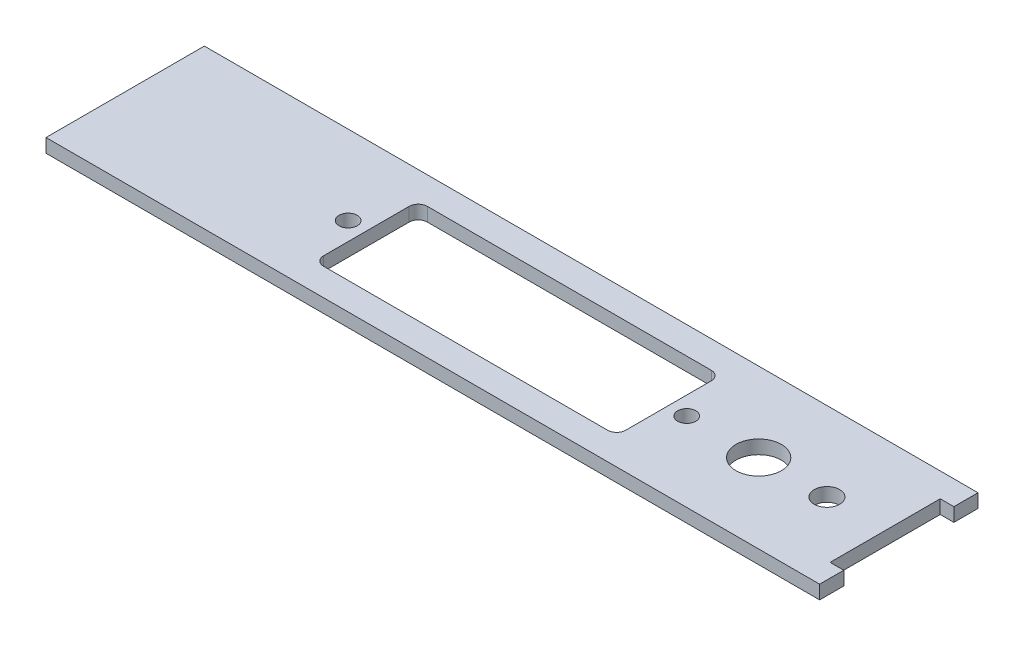
ISO-10303-21;
HEADER;
FILE_DESCRIPTION(('STEP AP214'),'2;1');
FILE_NAME('part.step','',(''),(''),'','','');
FILE_SCHEMA(('AUTOMOTIVE_DESIGN { 1 0 10303 214 1 1 1 1 }'));
ENDSEC;
DATA;
#1=APPLICATION_CONTEXT('core data for automotive mechanical design processes');
#2=APPLICATION_PROTOCOL_DEFINITION('international standard','automotive_design',2000,#1);
#3=PRODUCT_CONTEXT('',#1,'mechanical');
#4=PRODUCT('Part','Part','',(#3));
#5=PRODUCT_RELATED_PRODUCT_CATEGORY('part','',(#4));
#6=PRODUCT_DEFINITION_FORMATION('','',#4);
#7=PRODUCT_DEFINITION_CONTEXT('part definition',#1,'design');
#8=PRODUCT_DEFINITION('design','',#6,#7);
#9=PRODUCT_DEFINITION_SHAPE('','',#8);
#10=(LENGTH_UNIT() NAMED_UNIT(*) SI_UNIT(.MILLI.,.METRE.));
#11=(NAMED_UNIT(*) PLANE_ANGLE_UNIT() SI_UNIT($,.RADIAN.));
#12=(NAMED_UNIT(*) SI_UNIT($,.STERADIAN.) SOLID_ANGLE_UNIT());
#13=UNCERTAINTY_MEASURE_WITH_UNIT(LENGTH_MEASURE(1.E-05),#10,'distance_accuracy_value','');
#14=(GEOMETRIC_REPRESENTATION_CONTEXT(3) GLOBAL_UNCERTAINTY_ASSIGNED_CONTEXT((#13)) GLOBAL_UNIT_ASSIGNED_CONTEXT((#10,
#11,#12)) REPRESENTATION_CONTEXT('',''));
#15=CARTESIAN_POINT('',(0.,0.,0.));
#16=DIRECTION('',(0.,0.,1.));
#17=DIRECTION('',(1.,0.,0.));
#18=AXIS2_PLACEMENT_3D('',#15,#16,#17);
#19=CARTESIAN_POINT('',(0.,15.,0.));
#20=DIRECTION('',(0.,1.,0.));
#21=DIRECTION('',(0.,0.,1.));
#22=AXIS2_PLACEMENT_3D('',#19,#20,#21);
#23=PLANE('',#22);
#24=CARTESIAN_POINT('',(340.,15.,0.));
#25=DIRECTION('',(0.,1.,0.));
#26=DIRECTION('',(0.,0.,1.));
#27=AXIS2_PLACEMENT_3D('',#24,#25,#26);
#28=CIRCLE('',#27,14.);
#29=CARTESIAN_POINT('',(340.,15.,14.));
#30=VERTEX_POINT('',#29);
#31=EDGE_CURVE('E187',#30,#30,#28,.F.);
#32=ORIENTED_EDGE('',*,*,#31,.T.);
#33=EDGE_LOOP('',(#32));
#34=FACE_BOUND('',#33,.T.);
#35=CARTESIAN_POINT('',(186.,15.,0.));
#36=DIRECTION('',(0.,-1.,0.));
#37=DIRECTION('',(0.,0.,-1.));
#38=AXIS2_PLACEMENT_3D('',#35,#36,#37);
#39=CIRCLE('',#38,10.);
#40=CARTESIAN_POINT('',(186.,15.,-10.));
#41=VERTEX_POINT('',#40);
#42=EDGE_CURVE('E190',#41,#41,#39,.T.);
#43=ORIENTED_EDGE('',*,*,#42,.T.);
#44=EDGE_LOOP('',(#43));
#45=FACE_BOUND('',#44,.T.);
#46=CARTESIAN_POINT('',(-186.,15.,0.));
#47=DIRECTION('',(0.,-1.,0.));
#48=DIRECTION('',(0.,0.,-1.));
#49=AXIS2_PLACEMENT_3D('',#46,#47,#48);
#50=CIRCLE('',#49,10.);
#51=CARTESIAN_POINT('',(-186.,15.,-10.));
#52=VERTEX_POINT('',#51);
#53=EDGE_CURVE('E193',#52,#52,#50,.T.);
#54=ORIENTED_EDGE('',*,*,#53,.T.);
#55=EDGE_LOOP('',(#54));
#56=FACE_BOUND('',#55,.T.);
#57=CARTESIAN_POINT('',(156.,15.,47.));
#58=DIRECTION('',(0.,1.,0.));
#59=DIRECTION('',(0.,0.,1.));
#60=AXIS2_PLACEMENT_3D('',#57,#58,#59);
#61=CIRCLE('',#60,10.);
#62=CARTESIAN_POINT('',(166.,15.,47.));
#63=VERTEX_POINT('',#62);
#64=CARTESIAN_POINT('',(156.,15.,57.));
#65=VERTEX_POINT('',#64);
#66=EDGE_CURVE('E161',#63,#65,#61,.F.);
#67=ORIENTED_EDGE('',*,*,#66,.T.);
#68=DIRECTION('',(-1.,0.,0.));
#69=VECTOR('',#68,1.);
#70=CARTESIAN_POINT('',(166.,15.,57.));
#71=LINE('',#70,#69);
#72=CARTESIAN_POINT('',(-156.,15.,57.));
#73=VERTEX_POINT('',#72);
#74=EDGE_CURVE('E159',#73,#65,#71,.F.);
#75=ORIENTED_EDGE('',*,*,#74,.F.);
#76=CARTESIAN_POINT('',(-156.,15.,47.));
#77=DIRECTION('',(0.,1.,0.));
#78=DIRECTION('',(0.,0.,1.));
#79=AXIS2_PLACEMENT_3D('',#76,#77,#78);
#80=CIRCLE('',#79,10.);
#81=CARTESIAN_POINT('',(-166.,15.,47.));
#82=VERTEX_POINT('',#81);
#83=EDGE_CURVE('E158',#73,#82,#80,.F.);
#84=ORIENTED_EDGE('',*,*,#83,.T.);
#85=DIRECTION('',(0.,0.,-1.));
#86=VECTOR('',#85,1.);
#87=CARTESIAN_POINT('',(-166.,15.,57.));
#88=LINE('',#87,#86);
#89=CARTESIAN_POINT('',(-166.,15.,-47.));
#90=VERTEX_POINT('',#89);
#91=EDGE_CURVE('E155',#90,#82,#88,.F.);
#92=ORIENTED_EDGE('',*,*,#91,.F.);
#93=CARTESIAN_POINT('',(-156.,15.,-47.));
#94=DIRECTION('',(0.,1.,0.));
#95=DIRECTION('',(0.,0.,1.));
#96=AXIS2_PLACEMENT_3D('',#93,#94,#95);
#97=CIRCLE('',#96,10.);
#98=CARTESIAN_POINT('',(-156.,15.,-57.));
#99=VERTEX_POINT('',#98);
#100=EDGE_CURVE('E152',#90,#99,#97,.F.);
#101=ORIENTED_EDGE('',*,*,#100,.T.);
#102=DIRECTION('',(1.,0.,0.));
#103=VECTOR('',#102,1.);
#104=CARTESIAN_POINT('',(-166.,15.,-57.));
#105=LINE('',#104,#103);
#106=CARTESIAN_POINT('',(156.,15.,-57.));
#107=VERTEX_POINT('',#106);
#108=EDGE_CURVE('E149',#107,#99,#105,.F.);
#109=ORIENTED_EDGE('',*,*,#108,.F.);
#110=CARTESIAN_POINT('',(156.,15.,-47.));
#111=DIRECTION('',(0.,1.,0.));
#112=DIRECTION('',(0.,0.,1.));
#113=AXIS2_PLACEMENT_3D('',#110,#111,#112);
#114=CIRCLE('',#113,10.);
#115=CARTESIAN_POINT('',(166.,15.,-47.));
#116=VERTEX_POINT('',#115);
#117=EDGE_CURVE('E196',#107,#116,#114,.F.);
#118=ORIENTED_EDGE('',*,*,#117,.T.);
#119=DIRECTION('',(0.,0.,1.));
#120=VECTOR('',#119,1.);
#121=CARTESIAN_POINT('',(166.,15.,-57.));
#122=LINE('',#121,#120);
#123=EDGE_CURVE('E86',#63,#116,#122,.F.);
#124=ORIENTED_EDGE('',*,*,#123,.F.);
#125=EDGE_LOOP('',(#67,#75,#84,#92,#101,#109,#118,#124));
#126=FACE_BOUND('',#125,.T.);
#127=CARTESIAN_POINT('',(265.,15.,0.));
#128=DIRECTION('',(0.,1.,0.));
#129=DIRECTION('',(0.,0.,1.));
#130=AXIS2_PLACEMENT_3D('',#127,#128,#129);
#131=CIRCLE('',#130,25.);
#132=CARTESIAN_POINT('',(265.,15.,25.));
#133=VERTEX_POINT('',#132);
#134=EDGE_CURVE('E20',#133,#133,#131,.F.);
#135=ORIENTED_EDGE('',*,*,#134,.T.);
#136=EDGE_LOOP('',(#135));
#137=FACE_BOUND('',#136,.T.);
#138=DIRECTION('',(-1.,0.,0.));
#139=VECTOR('',#138,1.);
#140=CARTESIAN_POINT('',(419.,15.,-87.));
#141=LINE('',#140,#139);
#142=CARTESIAN_POINT('',(-431.,15.,-87.));
#143=VERTEX_POINT('',#142);
#144=CARTESIAN_POINT('',(419.,15.,-87.));
#145=VERTEX_POINT('',#144);
#146=EDGE_CURVE('E96',#143,#145,#141,.F.);
#147=ORIENTED_EDGE('',*,*,#146,.F.);
#148=DIRECTION('',(0.,0.,1.));
#149=VECTOR('',#148,1.);
#150=CARTESIAN_POINT('',(-431.,15.,-87.));
#151=LINE('',#150,#149);
#152=CARTESIAN_POINT('',(-431.,15.,87.));
#153=VERTEX_POINT('',#152);
#154=EDGE_CURVE('E136',#153,#143,#151,.F.);
#155=ORIENTED_EDGE('',*,*,#154,.F.);
#156=DIRECTION('',(1.,0.,0.));
#157=VECTOR('',#156,1.);
#158=CARTESIAN_POINT('',(-431.,15.,87.));
#159=LINE('',#158,#157);
#160=CARTESIAN_POINT('',(419.,15.,87.));
#161=VERTEX_POINT('',#160);
#162=EDGE_CURVE('E127',#161,#153,#159,.F.);
#163=ORIENTED_EDGE('',*,*,#162,.F.);
#164=DIRECTION('',(0.,0.,-1.));
#165=VECTOR('',#164,1.);
#166=CARTESIAN_POINT('',(419.,15.,87.));
#167=LINE('',#166,#165);
#168=CARTESIAN_POINT('',(419.,15.,60.5));
#169=VERTEX_POINT('',#168);
#170=EDGE_CURVE('E121',#169,#161,#167,.F.);
#171=ORIENTED_EDGE('',*,*,#170,.F.);
#172=DIRECTION('',(-1.,0.,0.));
#173=VECTOR('',#172,1.);
#174=CARTESIAN_POINT('',(419.,15.,60.5));
#175=LINE('',#174,#173);
#176=CARTESIAN_POINT('',(404.,15.,60.5));
#177=VERTEX_POINT('',#176);
#178=EDGE_CURVE('E234',#177,#169,#175,.F.);
#179=ORIENTED_EDGE('',*,*,#178,.F.);
#180=DIRECTION('',(0.,0.,-1.));
#181=VECTOR('',#180,1.);
#182=CARTESIAN_POINT('',(404.,15.,60.5));
#183=LINE('',#182,#181);
#184=CARTESIAN_POINT('',(404.,15.,-60.5));
#185=VERTEX_POINT('',#184);
#186=EDGE_CURVE('E229',#185,#177,#183,.F.);
#187=ORIENTED_EDGE('',*,*,#186,.F.);
#188=DIRECTION('',(1.,0.,0.));
#189=VECTOR('',#188,1.);
#190=CARTESIAN_POINT('',(404.,15.,-60.5));
#191=LINE('',#190,#189);
#192=CARTESIAN_POINT('',(419.,15.,-60.5));
#193=VERTEX_POINT('',#192);
#194=EDGE_CURVE('E224',#193,#185,#191,.F.);
#195=ORIENTED_EDGE('',*,*,#194,.F.);
#196=DIRECTION('',(0.,0.,-1.));
#197=VECTOR('',#196,1.);
#198=CARTESIAN_POINT('',(419.,15.,-60.5));
#199=LINE('',#198,#197);
#200=EDGE_CURVE('E219',#145,#193,#199,.F.);
#201=ORIENTED_EDGE('',*,*,#200,.F.);
#202=EDGE_LOOP('',(#147,#155,#163,#171,#179,#187,#195,#201));
#203=FACE_BOUND('',#202,.T.);
#204=ADVANCED_FACE('F17',(#34,#45,#56,#126,#137,#203),#23,.T.);
#205=CARTESIAN_POINT('',(-431.,0.,-87.));
#206=DIRECTION('',(-1.,0.,0.));
#207=DIRECTION('',(0.,0.,1.));
#208=AXIS2_PLACEMENT_3D('',#205,#206,#207);
#209=PLANE('',#208);
#210=DIRECTION('',(0.,1.,0.));
#211=VECTOR('',#210,1.);
#212=CARTESIAN_POINT('',(-431.,0.,-87.));
#213=LINE('',#212,#211);
#214=CARTESIAN_POINT('',(-431.,0.,-87.));
#215=VERTEX_POINT('',#214);
#216=EDGE_CURVE('E214',#215,#143,#213,.T.);
#217=ORIENTED_EDGE('',*,*,#216,.F.);
#218=DIRECTION('',(0.,0.,1.));
#219=VECTOR('',#218,1.);
#220=CARTESIAN_POINT('',(-431.,0.,0.));
#221=LINE('',#220,#219);
#222=CARTESIAN_POINT('',(-431.,0.,87.));
#223=VERTEX_POINT('',#222);
#224=EDGE_CURVE('E144',#215,#223,#221,.T.);
#225=ORIENTED_EDGE('',*,*,#224,.T.);
#226=DIRECTION('',(0.,1.,0.));
#227=VECTOR('',#226,1.);
#228=CARTESIAN_POINT('',(-431.,0.,87.));
#229=LINE('',#228,#227);
#230=EDGE_CURVE('E132',#153,#223,#229,.F.);
#231=ORIENTED_EDGE('',*,*,#230,.F.);
#232=ORIENTED_EDGE('',*,*,#154,.T.);
#233=EDGE_LOOP('',(#217,#225,#231,#232));
#234=FACE_BOUND('',#233,.T.);
#235=ADVANCED_FACE('F142',(#234),#209,.T.);
#236=CARTESIAN_POINT('',(-431.,0.,87.));
#237=DIRECTION('',(0.,0.,1.));
#238=DIRECTION('',(1.,0.,0.));
#239=AXIS2_PLACEMENT_3D('',#236,#237,#238);
#240=PLANE('',#239);
#241=ORIENTED_EDGE('',*,*,#230,.T.);
#242=DIRECTION('',(1.,0.,0.));
#243=VECTOR('',#242,1.);
#244=CARTESIAN_POINT('',(0.,0.,87.));
#245=LINE('',#244,#243);
#246=CARTESIAN_POINT('',(419.,0.,87.));
#247=VERTEX_POINT('',#246);
#248=EDGE_CURVE('E246',#223,#247,#245,.T.);
#249=ORIENTED_EDGE('',*,*,#248,.T.);
#250=DIRECTION('',(0.,1.,0.));
#251=VECTOR('',#250,1.);
#252=CARTESIAN_POINT('',(419.,0.,87.));
#253=LINE('',#252,#251);
#254=EDGE_CURVE('E134',#161,#247,#253,.F.);
#255=ORIENTED_EDGE('',*,*,#254,.F.);
#256=ORIENTED_EDGE('',*,*,#162,.T.);
#257=EDGE_LOOP('',(#241,#249,#255,#256));
#258=FACE_BOUND('',#257,.T.);
#259=ADVANCED_FACE('F129',(#258),#240,.T.);
#260=CARTESIAN_POINT('',(419.,0.,87.));
#261=DIRECTION('',(1.,0.,0.));
#262=DIRECTION('',(0.,0.,-1.));
#263=AXIS2_PLACEMENT_3D('',#260,#261,#262);
#264=PLANE('',#263);
#265=ORIENTED_EDGE('',*,*,#254,.T.);
#266=DIRECTION('',(0.,0.,1.));
#267=VECTOR('',#266,1.);
#268=CARTESIAN_POINT('',(419.,0.,0.));
#269=LINE('',#268,#267);
#270=CARTESIAN_POINT('',(419.,0.,60.5));
#271=VERTEX_POINT('',#270);
#272=EDGE_CURVE('E240',#247,#271,#269,.F.);
#273=ORIENTED_EDGE('',*,*,#272,.T.);
#274=DIRECTION('',(0.,1.,0.));
#275=VECTOR('',#274,1.);
#276=CARTESIAN_POINT('',(419.,0.,60.5));
#277=LINE('',#276,#275);
#278=EDGE_CURVE('E231',#169,#271,#277,.F.);
#279=ORIENTED_EDGE('',*,*,#278,.F.);
#280=ORIENTED_EDGE('',*,*,#170,.T.);
#281=EDGE_LOOP('',(#265,#273,#279,#280));
#282=FACE_BOUND('',#281,.T.);
#283=ADVANCED_FACE('F238',(#282),#264,.T.);
#284=CARTESIAN_POINT('',(419.,0.,60.5));
#285=DIRECTION('',(0.,0.,-1.));
#286=DIRECTION('',(-1.,0.,0.));
#287=AXIS2_PLACEMENT_3D('',#284,#285,#286);
#288=PLANE('',#287);
#289=ORIENTED_EDGE('',*,*,#278,.T.);
#290=DIRECTION('',(1.,0.,0.));
#291=VECTOR('',#290,1.);
#292=CARTESIAN_POINT('',(0.,0.,60.5));
#293=LINE('',#292,#291);
#294=CARTESIAN_POINT('',(404.,0.,60.5));
#295=VERTEX_POINT('',#294);
#296=EDGE_CURVE('E249',#271,#295,#293,.F.);
#297=ORIENTED_EDGE('',*,*,#296,.T.);
#298=DIRECTION('',(0.,1.,0.));
#299=VECTOR('',#298,1.);
#300=CARTESIAN_POINT('',(404.,0.,60.5));
#301=LINE('',#300,#299);
#302=EDGE_CURVE('E226',#177,#295,#301,.F.);
#303=ORIENTED_EDGE('',*,*,#302,.F.);
#304=ORIENTED_EDGE('',*,*,#178,.T.);
#305=EDGE_LOOP('',(#289,#297,#303,#304));
#306=FACE_BOUND('',#305,.T.);
#307=ADVANCED_FACE('F351',(#306),#288,.T.);
#308=CARTESIAN_POINT('',(404.,0.,60.5));
#309=DIRECTION('',(1.,0.,0.));
#310=DIRECTION('',(0.,0.,-1.));
#311=AXIS2_PLACEMENT_3D('',#308,#309,#310);
#312=PLANE('',#311);
#313=ORIENTED_EDGE('',*,*,#302,.T.);
#314=DIRECTION('',(0.,0.,1.));
#315=VECTOR('',#314,1.);
#316=CARTESIAN_POINT('',(404.,0.,0.));
#317=LINE('',#316,#315);
#318=CARTESIAN_POINT('',(404.,0.,-60.5));
#319=VERTEX_POINT('',#318);
#320=EDGE_CURVE('E346',#295,#319,#317,.F.);
#321=ORIENTED_EDGE('',*,*,#320,.T.);
#322=DIRECTION('',(0.,1.,0.));
#323=VECTOR('',#322,1.);
#324=CARTESIAN_POINT('',(404.,0.,-60.5));
#325=LINE('',#324,#323);
#326=EDGE_CURVE('E221',#185,#319,#325,.F.);
#327=ORIENTED_EDGE('',*,*,#326,.F.);
#328=ORIENTED_EDGE('',*,*,#186,.T.);
#329=EDGE_LOOP('',(#313,#321,#327,#328));
#330=FACE_BOUND('',#329,.T.);
#331=ADVANCED_FACE('F372',(#330),#312,.T.);
#332=CARTESIAN_POINT('',(404.,0.,-60.5));
#333=DIRECTION('',(0.,0.,1.));
#334=DIRECTION('',(1.,0.,0.));
#335=AXIS2_PLACEMENT_3D('',#332,#333,#334);
#336=PLANE('',#335);
#337=ORIENTED_EDGE('',*,*,#326,.T.);
#338=DIRECTION('',(1.,0.,0.));
#339=VECTOR('',#338,1.);
#340=CARTESIAN_POINT('',(0.,0.,-60.5));
#341=LINE('',#340,#339);
#342=CARTESIAN_POINT('',(419.,0.,-60.5));
#343=VERTEX_POINT('',#342);
#344=EDGE_CURVE('E343',#319,#343,#341,.T.);
#345=ORIENTED_EDGE('',*,*,#344,.T.);
#346=DIRECTION('',(0.,1.,0.));
#347=VECTOR('',#346,1.);
#348=CARTESIAN_POINT('',(419.,0.,-60.5));
#349=LINE('',#348,#347);
#350=EDGE_CURVE('E216',#193,#343,#349,.F.);
#351=ORIENTED_EDGE('',*,*,#350,.F.);
#352=ORIENTED_EDGE('',*,*,#194,.T.);
#353=EDGE_LOOP('',(#337,#345,#351,#352));
#354=FACE_BOUND('',#353,.T.);
#355=ADVANCED_FACE('F369',(#354),#336,.T.);
#356=CARTESIAN_POINT('',(419.,0.,-60.5));
#357=DIRECTION('',(1.,0.,0.));
#358=DIRECTION('',(0.,0.,-1.));
#359=AXIS2_PLACEMENT_3D('',#356,#357,#358);
#360=PLANE('',#359);
#361=ORIENTED_EDGE('',*,*,#350,.T.);
#362=DIRECTION('',(0.,0.,1.));
#363=VECTOR('',#362,1.);
#364=CARTESIAN_POINT('',(419.,0.,0.));
#365=LINE('',#364,#363);
#366=CARTESIAN_POINT('',(419.,0.,-87.));
#367=VERTEX_POINT('',#366);
#368=EDGE_CURVE('E340',#343,#367,#365,.F.);
#369=ORIENTED_EDGE('',*,*,#368,.T.);
#370=DIRECTION('',(0.,1.,0.));
#371=VECTOR('',#370,1.);
#372=CARTESIAN_POINT('',(419.,0.,-87.));
#373=LINE('',#372,#371);
#374=EDGE_CURVE('E211',#145,#367,#373,.F.);
#375=ORIENTED_EDGE('',*,*,#374,.F.);
#376=ORIENTED_EDGE('',*,*,#200,.T.);
#377=EDGE_LOOP('',(#361,#369,#375,#376));
#378=FACE_BOUND('',#377,.T.);
#379=ADVANCED_FACE('F364',(#378),#360,.T.);
#380=CARTESIAN_POINT('',(419.,0.,-87.));
#381=DIRECTION('',(0.,0.,-1.));
#382=DIRECTION('',(-1.,0.,0.));
#383=AXIS2_PLACEMENT_3D('',#380,#381,#382);
#384=PLANE('',#383);
#385=ORIENTED_EDGE('',*,*,#374,.T.);
#386=DIRECTION('',(1.,0.,0.));
#387=VECTOR('',#386,1.);
#388=CARTESIAN_POINT('',(0.,0.,-87.));
#389=LINE('',#388,#387);
#390=EDGE_CURVE('E186',#367,#215,#389,.F.);
#391=ORIENTED_EDGE('',*,*,#390,.T.);
#392=ORIENTED_EDGE('',*,*,#216,.T.);
#393=ORIENTED_EDGE('',*,*,#146,.T.);
#394=EDGE_LOOP('',(#385,#391,#392,#393));
#395=FACE_BOUND('',#394,.T.);
#396=ADVANCED_FACE('F360',(#395),#384,.T.);
#397=CARTESIAN_POINT('',(265.,0.,0.));
#398=DIRECTION('',(0.,1.,0.));
#399=DIRECTION('',(0.,0.,1.));
#400=AXIS2_PLACEMENT_3D('',#397,#398,#399);
#401=CYLINDRICAL_SURFACE('',#400,25.);
#402=ORIENTED_EDGE('',*,*,#134,.F.);
#403=EDGE_LOOP('',(#402));
#404=FACE_BOUND('',#403,.T.);
#405=CARTESIAN_POINT('',(265.,0.,0.));
#406=DIRECTION('',(0.,1.,0.));
#407=DIRECTION('',(0.,0.,1.));
#408=AXIS2_PLACEMENT_3D('',#405,#406,#407);
#409=CIRCLE('',#408,25.);
#410=CARTESIAN_POINT('',(265.,0.,25.));
#411=VERTEX_POINT('',#410);
#412=EDGE_CURVE('E183',#411,#411,#409,.F.);
#413=ORIENTED_EDGE('',*,*,#412,.T.);
#414=EDGE_LOOP('',(#413));
#415=FACE_BOUND('',#414,.T.);
#416=ADVANCED_FACE('F286',(#404,#415),#401,.F.);
#417=CARTESIAN_POINT('',(166.,0.,-57.));
#418=DIRECTION('',(-1.,0.,0.));
#419=DIRECTION('',(0.,0.,1.));
#420=AXIS2_PLACEMENT_3D('',#417,#418,#419);
#421=PLANE('',#420);
#422=DIRECTION('',(0.,0.,1.));
#423=VECTOR('',#422,1.);
#424=CARTESIAN_POINT('',(166.,0.,0.));
#425=LINE('',#424,#423);
#426=CARTESIAN_POINT('',(166.,0.,-47.));
#427=VERTEX_POINT('',#426);
#428=CARTESIAN_POINT('',(166.,0.,47.));
#429=VERTEX_POINT('',#428);
#430=EDGE_CURVE('E182',#427,#429,#425,.T.);
#431=ORIENTED_EDGE('',*,*,#430,.T.);
#432=DIRECTION('',(0.,1.,0.));
#433=VECTOR('',#432,1.);
#434=CARTESIAN_POINT('',(166.,-1.16803736518,47.));
#435=LINE('',#434,#433);
#436=EDGE_CURVE('E154',#429,#63,#435,.T.);
#437=ORIENTED_EDGE('',*,*,#436,.T.);
#438=ORIENTED_EDGE('',*,*,#123,.T.);
#439=DIRECTION('',(0.,1.,0.));
#440=VECTOR('',#439,1.);
#441=CARTESIAN_POINT('',(166.,-1.16803736518,-47.));
#442=LINE('',#441,#440);
#443=EDGE_CURVE('E255',#116,#427,#442,.F.);
#444=ORIENTED_EDGE('',*,*,#443,.T.);
#445=EDGE_LOOP('',(#431,#437,#438,#444));
#446=FACE_BOUND('',#445,.T.);
#447=ADVANCED_FACE('F277',(#446),#421,.T.);
#448=CARTESIAN_POINT('',(156.,-1.16803736518,47.));
#449=DIRECTION('',(0.,1.,0.));
#450=DIRECTION('',(0.,0.,1.));
#451=AXIS2_PLACEMENT_3D('',#448,#449,#450);
#452=CYLINDRICAL_SURFACE('',#451,10.);
#453=ORIENTED_EDGE('',*,*,#436,.F.);
#454=CARTESIAN_POINT('',(156.,0.,47.));
#455=DIRECTION('',(0.,1.,0.));
#456=DIRECTION('',(0.,0.,1.));
#457=AXIS2_PLACEMENT_3D('',#454,#455,#456);
#458=CIRCLE('',#457,10.);
#459=CARTESIAN_POINT('',(156.,0.,57.));
#460=VERTEX_POINT('',#459);
#461=EDGE_CURVE('E179',#429,#460,#458,.F.);
#462=ORIENTED_EDGE('',*,*,#461,.T.);
#463=DIRECTION('',(0.,1.,0.));
#464=VECTOR('',#463,1.);
#465=CARTESIAN_POINT('',(156.,0.,57.));
#466=LINE('',#465,#464);
#467=EDGE_CURVE('E160',#65,#460,#466,.F.);
#468=ORIENTED_EDGE('',*,*,#467,.F.);
#469=ORIENTED_EDGE('',*,*,#66,.F.);
#470=EDGE_LOOP('',(#453,#462,#468,#469));
#471=FACE_BOUND('',#470,.T.);
#472=ADVANCED_FACE('F275',(#471),#452,.F.);
#473=CARTESIAN_POINT('',(166.,0.,57.));
#474=DIRECTION('',(0.,0.,-1.));
#475=DIRECTION('',(-1.,0.,0.));
#476=AXIS2_PLACEMENT_3D('',#473,#474,#475);
#477=PLANE('',#476);
#478=DIRECTION('',(1.,0.,0.));
#479=VECTOR('',#478,1.);
#480=CARTESIAN_POINT('',(0.,0.,57.));
#481=LINE('',#480,#479);
#482=CARTESIAN_POINT('',(-156.,0.,57.));
#483=VERTEX_POINT('',#482);
#484=EDGE_CURVE('E178',#460,#483,#481,.F.);
#485=ORIENTED_EDGE('',*,*,#484,.T.);
#486=DIRECTION('',(0.,1.,0.));
#487=VECTOR('',#486,1.);
#488=CARTESIAN_POINT('',(-156.,-1.16803736518,57.));
#489=LINE('',#488,#487);
#490=EDGE_CURVE('E202',#483,#73,#489,.T.);
#491=ORIENTED_EDGE('',*,*,#490,.T.);
#492=ORIENTED_EDGE('',*,*,#74,.T.);
#493=ORIENTED_EDGE('',*,*,#467,.T.);
#494=EDGE_LOOP('',(#485,#491,#492,#493));
#495=FACE_BOUND('',#494,.T.);
#496=ADVANCED_FACE('F266',(#495),#477,.T.);
#497=CARTESIAN_POINT('',(-156.,-1.16803736518,47.));
#498=DIRECTION('',(0.,1.,0.));
#499=DIRECTION('',(0.,0.,1.));
#500=AXIS2_PLACEMENT_3D('',#497,#498,#499);
#501=CYLINDRICAL_SURFACE('',#500,10.);
#502=ORIENTED_EDGE('',*,*,#490,.F.);
#503=CARTESIAN_POINT('',(-156.,0.,47.));
#504=DIRECTION('',(0.,1.,0.));
#505=DIRECTION('',(0.,0.,1.));
#506=AXIS2_PLACEMENT_3D('',#503,#504,#505);
#507=CIRCLE('',#506,10.);
#508=CARTESIAN_POINT('',(-166.,0.,47.));
#509=VERTEX_POINT('',#508);
#510=EDGE_CURVE('E175',#483,#509,#507,.F.);
#511=ORIENTED_EDGE('',*,*,#510,.T.);
#512=DIRECTION('',(0.,1.,0.));
#513=VECTOR('',#512,1.);
#514=CARTESIAN_POINT('',(-166.,0.,47.));
#515=LINE('',#514,#513);
#516=EDGE_CURVE('E157',#82,#509,#515,.F.);
#517=ORIENTED_EDGE('',*,*,#516,.F.);
#518=ORIENTED_EDGE('',*,*,#83,.F.);
#519=EDGE_LOOP('',(#502,#511,#517,#518));
#520=FACE_BOUND('',#519,.T.);
#521=ADVANCED_FACE('F284',(#520),#501,.F.);
#522=CARTESIAN_POINT('',(-166.,0.,57.));
#523=DIRECTION('',(1.,0.,0.));
#524=DIRECTION('',(0.,0.,-1.));
#525=AXIS2_PLACEMENT_3D('',#522,#523,#524);
#526=PLANE('',#525);
#527=ORIENTED_EDGE('',*,*,#91,.T.);
#528=ORIENTED_EDGE('',*,*,#516,.T.);
#529=DIRECTION('',(0.,0.,1.));
#530=VECTOR('',#529,1.);
#531=CARTESIAN_POINT('',(-166.,0.,0.));
#532=LINE('',#531,#530);
#533=CARTESIAN_POINT('',(-166.,0.,-47.));
#534=VERTEX_POINT('',#533);
#535=EDGE_CURVE('E174',#509,#534,#532,.F.);
#536=ORIENTED_EDGE('',*,*,#535,.T.);
#537=DIRECTION('',(0.,1.,0.));
#538=VECTOR('',#537,1.);
#539=CARTESIAN_POINT('',(-166.,-1.16803736518,-47.));
#540=LINE('',#539,#538);
#541=EDGE_CURVE('E200',#534,#90,#540,.T.);
#542=ORIENTED_EDGE('',*,*,#541,.T.);
#543=EDGE_LOOP('',(#527,#528,#536,#542));
#544=FACE_BOUND('',#543,.T.);
#545=ADVANCED_FACE('F318',(#544),#526,.T.);
#546=CARTESIAN_POINT('',(-156.,-1.16803736518,-47.));
#547=DIRECTION('',(0.,1.,0.));
#548=DIRECTION('',(0.,0.,1.));
#549=AXIS2_PLACEMENT_3D('',#546,#547,#548);
#550=CYLINDRICAL_SURFACE('',#549,10.);
#551=ORIENTED_EDGE('',*,*,#541,.F.);
#552=CARTESIAN_POINT('',(-156.,0.,-47.));
#553=DIRECTION('',(0.,1.,0.));
#554=DIRECTION('',(0.,0.,1.));
#555=AXIS2_PLACEMENT_3D('',#552,#553,#554);
#556=CIRCLE('',#555,10.);
#557=CARTESIAN_POINT('',(-156.,0.,-57.));
#558=VERTEX_POINT('',#557);
#559=EDGE_CURVE('E171',#534,#558,#556,.F.);
#560=ORIENTED_EDGE('',*,*,#559,.T.);
#561=DIRECTION('',(0.,1.,0.));
#562=VECTOR('',#561,1.);
#563=CARTESIAN_POINT('',(-156.,0.,-57.));
#564=LINE('',#563,#562);
#565=EDGE_CURVE('E151',#99,#558,#564,.F.);
#566=ORIENTED_EDGE('',*,*,#565,.F.);
#567=ORIENTED_EDGE('',*,*,#100,.F.);
#568=EDGE_LOOP('',(#551,#560,#566,#567));
#569=FACE_BOUND('',#568,.T.);
#570=ADVANCED_FACE('F314',(#569),#550,.F.);
#571=CARTESIAN_POINT('',(-166.,0.,-57.));
#572=DIRECTION('',(0.,0.,1.));
#573=DIRECTION('',(1.,0.,0.));
#574=AXIS2_PLACEMENT_3D('',#571,#572,#573);
#575=PLANE('',#574);
#576=DIRECTION('',(1.,0.,0.));
#577=VECTOR('',#576,1.);
#578=CARTESIAN_POINT('',(0.,0.,-57.));
#579=LINE('',#578,#577);
#580=CARTESIAN_POINT('',(156.,0.,-57.));
#581=VERTEX_POINT('',#580);
#582=EDGE_CURVE('E170',#558,#581,#579,.T.);
#583=ORIENTED_EDGE('',*,*,#582,.T.);
#584=DIRECTION('',(0.,1.,0.));
#585=VECTOR('',#584,1.);
#586=CARTESIAN_POINT('',(156.,-1.16803736518,-57.));
#587=LINE('',#586,#585);
#588=EDGE_CURVE('E35',#581,#107,#587,.T.);
#589=ORIENTED_EDGE('',*,*,#588,.T.);
#590=ORIENTED_EDGE('',*,*,#108,.T.);
#591=ORIENTED_EDGE('',*,*,#565,.T.);
#592=EDGE_LOOP('',(#583,#589,#590,#591));
#593=FACE_BOUND('',#592,.T.);
#594=ADVANCED_FACE('F311',(#593),#575,.T.);
#595=CARTESIAN_POINT('',(156.,-1.16803736518,-47.));
#596=DIRECTION('',(0.,1.,0.));
#597=DIRECTION('',(0.,0.,1.));
#598=AXIS2_PLACEMENT_3D('',#595,#596,#597);
#599=CYLINDRICAL_SURFACE('',#598,10.);
#600=ORIENTED_EDGE('',*,*,#588,.F.);
#601=CARTESIAN_POINT('',(156.,0.,-47.));
#602=DIRECTION('',(0.,1.,0.));
#603=DIRECTION('',(0.,0.,1.));
#604=AXIS2_PLACEMENT_3D('',#601,#602,#603);
#605=CIRCLE('',#604,10.);
#606=EDGE_CURVE('E168',#581,#427,#605,.F.);
#607=ORIENTED_EDGE('',*,*,#606,.T.);
#608=ORIENTED_EDGE('',*,*,#443,.F.);
#609=ORIENTED_EDGE('',*,*,#117,.F.);
#610=EDGE_LOOP('',(#600,#607,#608,#609));
#611=FACE_BOUND('',#610,.T.);
#612=ADVANCED_FACE('F307',(#611),#599,.F.);
#613=CARTESIAN_POINT('',(-186.,15.,0.));
#614=DIRECTION('',(0.,-1.,0.));
#615=DIRECTION('',(0.,0.,-1.));
#616=AXIS2_PLACEMENT_3D('',#613,#614,#615);
#617=CYLINDRICAL_SURFACE('',#616,10.);
#618=ORIENTED_EDGE('',*,*,#53,.F.);
#619=EDGE_LOOP('',(#618));
#620=FACE_BOUND('',#619,.T.);
#621=CARTESIAN_POINT('',(-186.,0.,0.));
#622=DIRECTION('',(0.,-1.,0.));
#623=DIRECTION('',(0.,0.,-1.));
#624=AXIS2_PLACEMENT_3D('',#621,#622,#623);
#625=CIRCLE('',#624,10.);
#626=CARTESIAN_POINT('',(-186.,0.,-10.));
#627=VERTEX_POINT('',#626);
#628=EDGE_CURVE('E165',#627,#627,#625,.T.);
#629=ORIENTED_EDGE('',*,*,#628,.T.);
#630=EDGE_LOOP('',(#629));
#631=FACE_BOUND('',#630,.T.);
#632=ADVANCED_FACE('F303',(#620,#631),#617,.F.);
#633=CARTESIAN_POINT('',(186.,15.,0.));
#634=DIRECTION('',(0.,-1.,0.));
#635=DIRECTION('',(0.,0.,-1.));
#636=AXIS2_PLACEMENT_3D('',#633,#634,#635);
#637=CYLINDRICAL_SURFACE('',#636,10.);
#638=ORIENTED_EDGE('',*,*,#42,.F.);
#639=EDGE_LOOP('',(#638));
#640=FACE_BOUND('',#639,.T.);
#641=CARTESIAN_POINT('',(186.,0.,0.));
#642=DIRECTION('',(0.,-1.,0.));
#643=DIRECTION('',(0.,0.,-1.));
#644=AXIS2_PLACEMENT_3D('',#641,#642,#643);
#645=CIRCLE('',#644,10.);
#646=CARTESIAN_POINT('',(186.,0.,-10.));
#647=VERTEX_POINT('',#646);
#648=EDGE_CURVE('E26',#647,#647,#645,.T.);
#649=ORIENTED_EDGE('',*,*,#648,.T.);
#650=EDGE_LOOP('',(#649));
#651=FACE_BOUND('',#650,.T.);
#652=ADVANCED_FACE('F295',(#640,#651),#637,.F.);
#653=CARTESIAN_POINT('',(340.,-71.0063121584,0.));
#654=DIRECTION('',(0.,1.,0.));
#655=DIRECTION('',(0.,0.,1.));
#656=AXIS2_PLACEMENT_3D('',#653,#654,#655);
#657=CYLINDRICAL_SURFACE('',#656,14.);
#658=ORIENTED_EDGE('',*,*,#31,.F.);
#659=EDGE_LOOP('',(#658));
#660=FACE_BOUND('',#659,.T.);
#661=CARTESIAN_POINT('',(340.,0.,0.));
#662=DIRECTION('',(0.,1.,0.));
#663=DIRECTION('',(0.,0.,1.));
#664=AXIS2_PLACEMENT_3D('',#661,#662,#663);
#665=CIRCLE('',#664,14.);
#666=CARTESIAN_POINT('',(340.,0.,14.));
#667=VERTEX_POINT('',#666);
#668=EDGE_CURVE('E11',#667,#667,#665,.F.);
#669=ORIENTED_EDGE('',*,*,#668,.T.);
#670=EDGE_LOOP('',(#669));
#671=FACE_BOUND('',#670,.T.);
#672=ADVANCED_FACE('F289',(#660,#671),#657,.F.);
#673=CARTESIAN_POINT('',(0.,0.,0.));
#674=DIRECTION('',(0.,1.,0.));
#675=DIRECTION('',(0.,0.,1.));
#676=AXIS2_PLACEMENT_3D('',#673,#674,#675);
#677=PLANE('',#676);
#678=ORIENTED_EDGE('',*,*,#668,.F.);
#679=EDGE_LOOP('',(#678));
#680=FACE_BOUND('',#679,.T.);
#681=ORIENTED_EDGE('',*,*,#648,.F.);
#682=EDGE_LOOP('',(#681));
#683=FACE_BOUND('',#682,.T.);
#684=ORIENTED_EDGE('',*,*,#628,.F.);
#685=EDGE_LOOP('',(#684));
#686=FACE_BOUND('',#685,.T.);
#687=ORIENTED_EDGE('',*,*,#582,.F.);
#688=ORIENTED_EDGE('',*,*,#559,.F.);
#689=ORIENTED_EDGE('',*,*,#535,.F.);
#690=ORIENTED_EDGE('',*,*,#510,.F.);
#691=ORIENTED_EDGE('',*,*,#484,.F.);
#692=ORIENTED_EDGE('',*,*,#461,.F.);
#693=ORIENTED_EDGE('',*,*,#430,.F.);
#694=ORIENTED_EDGE('',*,*,#606,.F.);
#695=EDGE_LOOP('',(#687,#688,#689,#690,#691,#692,#693,#694));
#696=FACE_BOUND('',#695,.T.);
#697=ORIENTED_EDGE('',*,*,#412,.F.);
#698=EDGE_LOOP('',(#697));
#699=FACE_BOUND('',#698,.T.);
#700=ORIENTED_EDGE('',*,*,#368,.F.);
#701=ORIENTED_EDGE('',*,*,#344,.F.);
#702=ORIENTED_EDGE('',*,*,#320,.F.);
#703=ORIENTED_EDGE('',*,*,#296,.F.);
#704=ORIENTED_EDGE('',*,*,#272,.F.);
#705=ORIENTED_EDGE('',*,*,#248,.F.);
#706=ORIENTED_EDGE('',*,*,#224,.F.);
#707=ORIENTED_EDGE('',*,*,#390,.F.);
#708=EDGE_LOOP('',(#700,#701,#702,#703,#704,#705,#706,#707));
#709=FACE_BOUND('',#708,.T.);
#710=ADVANCED_FACE('F245',(#680,#683,#686,#696,#699,#709),#677,.F.);
#711=CLOSED_SHELL('',(#204,#235,#259,#283,#307,#331,#355,#379,#396,#416,#447,#472,#496,#521,
#545,#570,#594,#612,#632,#652,#672,#710));
#712=MANIFOLD_SOLID_BREP('B1',#711);
#713=ADVANCED_BREP_SHAPE_REPRESENTATION('',(#18,#712),#14);
#714=SHAPE_DEFINITION_REPRESENTATION(#9,#713);
ENDSEC;
END-ISO-10303-21;
